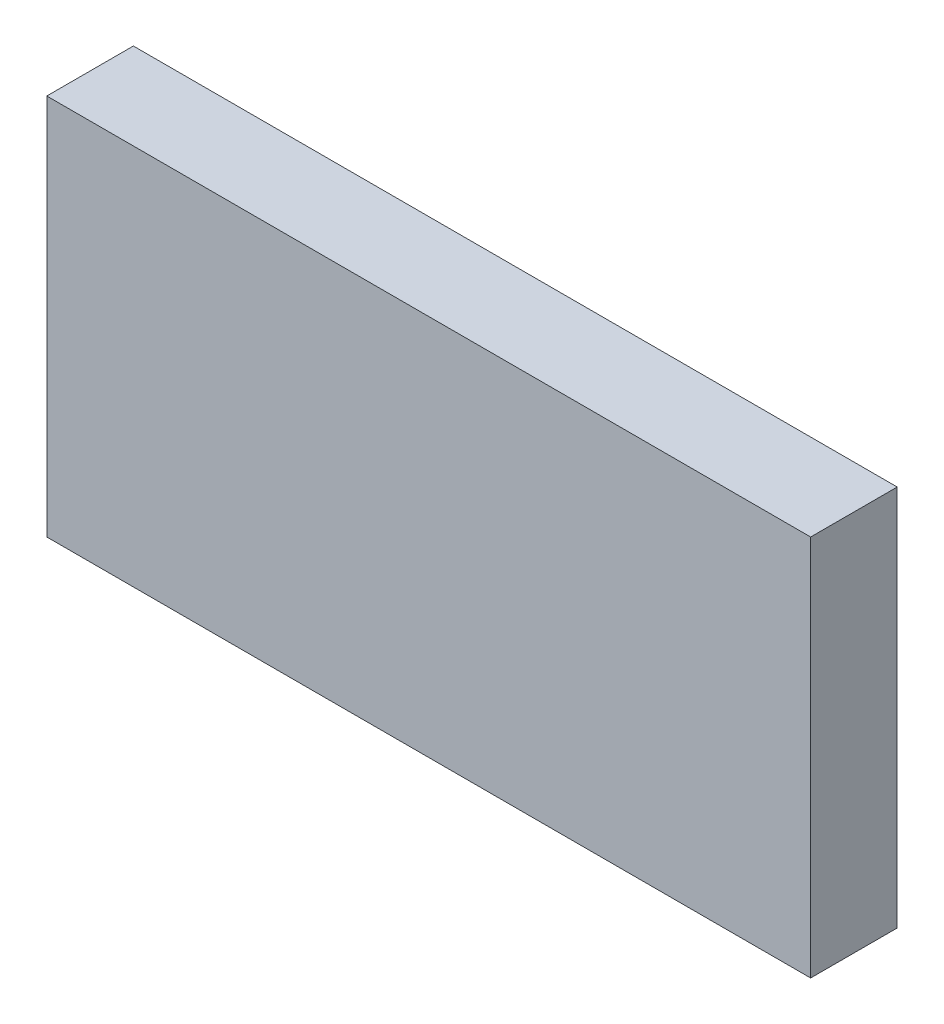
ISO-10303-21;
HEADER;
FILE_DESCRIPTION(('STEP AP214'),'2;1');
FILE_NAME('part.step','',(''),(''),'','','');
FILE_SCHEMA(('AUTOMOTIVE_DESIGN { 1 0 10303 214 1 1 1 1 }'));
ENDSEC;
DATA;
#1=APPLICATION_CONTEXT('core data for automotive mechanical design processes');
#2=APPLICATION_PROTOCOL_DEFINITION('international standard','automotive_design',2000,#1);
#3=PRODUCT_CONTEXT('',#1,'mechanical');
#4=PRODUCT('Part','Part','',(#3));
#5=PRODUCT_RELATED_PRODUCT_CATEGORY('part','',(#4));
#6=PRODUCT_DEFINITION_FORMATION('','',#4);
#7=PRODUCT_DEFINITION_CONTEXT('part definition',#1,'design');
#8=PRODUCT_DEFINITION('design','',#6,#7);
#9=PRODUCT_DEFINITION_SHAPE('','',#8);
#10=(LENGTH_UNIT() NAMED_UNIT(*) SI_UNIT(.MILLI.,.METRE.));
#11=(NAMED_UNIT(*) PLANE_ANGLE_UNIT() SI_UNIT($,.RADIAN.));
#12=(NAMED_UNIT(*) SI_UNIT($,.STERADIAN.) SOLID_ANGLE_UNIT());
#13=UNCERTAINTY_MEASURE_WITH_UNIT(LENGTH_MEASURE(1.E-05),#10,'distance_accuracy_value','');
#14=(GEOMETRIC_REPRESENTATION_CONTEXT(3) GLOBAL_UNCERTAINTY_ASSIGNED_CONTEXT((#13)) GLOBAL_UNIT_ASSIGNED_CONTEXT((#10,
#11,#12)) REPRESENTATION_CONTEXT('',''));
#15=CARTESIAN_POINT('',(0.,0.,0.));
#16=DIRECTION('',(0.,0.,1.));
#17=DIRECTION('',(1.,0.,0.));
#18=AXIS2_PLACEMENT_3D('',#15,#16,#17);
#19=CARTESIAN_POINT('',(0.,0.,3.4));
#20=DIRECTION('',(1.,0.,0.));
#21=DIRECTION('',(0.,0.,-1.));
#22=AXIS2_PLACEMENT_3D('',#19,#20,#21);
#23=PLANE('',#22);
#24=DIRECTION('',(0.,-1.,0.));
#25=VECTOR('',#24,1.);
#26=CARTESIAN_POINT('',(0.,0.,0.));
#27=LINE('',#26,#25);
#28=CARTESIAN_POINT('',(0.,15.,0.));
#29=VERTEX_POINT('',#28);
#30=CARTESIAN_POINT('',(0.,0.,0.));
#31=VERTEX_POINT('',#30);
#32=EDGE_CURVE('E95',#29,#31,#27,.T.);
#33=ORIENTED_EDGE('',*,*,#32,.T.);
#34=DIRECTION('',(0.,0.,-1.));
#35=VECTOR('',#34,1.);
#36=CARTESIAN_POINT('',(0.,0.,3.4));
#37=LINE('',#36,#35);
#38=CARTESIAN_POINT('',(0.,0.,3.4));
#39=VERTEX_POINT('',#38);
#40=EDGE_CURVE('E11',#39,#31,#37,.T.);
#41=ORIENTED_EDGE('',*,*,#40,.F.);
#42=DIRECTION('',(0.,-1.,0.));
#43=VECTOR('',#42,1.);
#44=CARTESIAN_POINT('',(0.,0.,3.4));
#45=LINE('',#44,#43);
#46=CARTESIAN_POINT('',(0.,15.,3.4));
#47=VERTEX_POINT('',#46);
#48=EDGE_CURVE('E83',#47,#39,#45,.T.);
#49=ORIENTED_EDGE('',*,*,#48,.F.);
#50=DIRECTION('',(0.,0.,-1.));
#51=VECTOR('',#50,1.);
#52=CARTESIAN_POINT('',(0.,15.,3.4));
#53=LINE('',#52,#51);
#54=EDGE_CURVE('E91',#47,#29,#53,.T.);
#55=ORIENTED_EDGE('',*,*,#54,.T.);
#56=EDGE_LOOP('',(#33,#41,#49,#55));
#57=FACE_BOUND('',#56,.T.);
#58=ADVANCED_FACE('F32',(#57),#23,.F.);
#59=CARTESIAN_POINT('',(0.,0.,3.4));
#60=DIRECTION('',(0.,1.,0.));
#61=DIRECTION('',(0.,0.,1.));
#62=AXIS2_PLACEMENT_3D('',#59,#60,#61);
#63=PLANE('',#62);
#64=DIRECTION('',(1.,0.,0.));
#65=VECTOR('',#64,1.);
#66=CARTESIAN_POINT('',(0.,0.,0.));
#67=LINE('',#66,#65);
#68=CARTESIAN_POINT('',(30.,0.,0.));
#69=VERTEX_POINT('',#68);
#70=EDGE_CURVE('E87',#31,#69,#67,.T.);
#71=ORIENTED_EDGE('',*,*,#70,.T.);
#72=DIRECTION('',(0.,0.,-1.));
#73=VECTOR('',#72,1.);
#74=CARTESIAN_POINT('',(30.,0.,3.4));
#75=LINE('',#74,#73);
#76=CARTESIAN_POINT('',(30.,0.,3.4));
#77=VERTEX_POINT('',#76);
#78=EDGE_CURVE('E40',#77,#69,#75,.T.);
#79=ORIENTED_EDGE('',*,*,#78,.F.);
#80=DIRECTION('',(1.,0.,0.));
#81=VECTOR('',#80,1.);
#82=CARTESIAN_POINT('',(0.,0.,3.4));
#83=LINE('',#82,#81);
#84=EDGE_CURVE('E78',#39,#77,#83,.T.);
#85=ORIENTED_EDGE('',*,*,#84,.F.);
#86=ORIENTED_EDGE('',*,*,#40,.T.);
#87=EDGE_LOOP('',(#71,#79,#85,#86));
#88=FACE_BOUND('',#87,.T.);
#89=ADVANCED_FACE('F86',(#88),#63,.F.);
#90=CARTESIAN_POINT('',(30.,0.,3.4));
#91=DIRECTION('',(-1.,0.,0.));
#92=DIRECTION('',(0.,0.,1.));
#93=AXIS2_PLACEMENT_3D('',#90,#91,#92);
#94=PLANE('',#93);
#95=DIRECTION('',(0.,1.,0.));
#96=VECTOR('',#95,1.);
#97=CARTESIAN_POINT('',(30.,0.,0.));
#98=LINE('',#97,#96);
#99=CARTESIAN_POINT('',(30.,15.,0.));
#100=VERTEX_POINT('',#99);
#101=EDGE_CURVE('E65',#69,#100,#98,.T.);
#102=ORIENTED_EDGE('',*,*,#101,.T.);
#103=DIRECTION('',(0.,0.,-1.));
#104=VECTOR('',#103,1.);
#105=CARTESIAN_POINT('',(30.,15.,3.4));
#106=LINE('',#105,#104);
#107=CARTESIAN_POINT('',(30.,15.,3.4));
#108=VERTEX_POINT('',#107);
#109=EDGE_CURVE('E88',#108,#100,#106,.T.);
#110=ORIENTED_EDGE('',*,*,#109,.F.);
#111=DIRECTION('',(0.,1.,0.));
#112=VECTOR('',#111,1.);
#113=CARTESIAN_POINT('',(30.,0.,3.4));
#114=LINE('',#113,#112);
#115=EDGE_CURVE('E81',#77,#108,#114,.T.);
#116=ORIENTED_EDGE('',*,*,#115,.F.);
#117=ORIENTED_EDGE('',*,*,#78,.T.);
#118=EDGE_LOOP('',(#102,#110,#116,#117));
#119=FACE_BOUND('',#118,.T.);
#120=ADVANCED_FACE('F89',(#119),#94,.F.);
#121=CARTESIAN_POINT('',(0.,15.,3.4));
#122=DIRECTION('',(0.,-1.,0.));
#123=DIRECTION('',(0.,0.,-1.));
#124=AXIS2_PLACEMENT_3D('',#121,#122,#123);
#125=PLANE('',#124);
#126=DIRECTION('',(-1.,0.,0.));
#127=VECTOR('',#126,1.);
#128=CARTESIAN_POINT('',(0.,15.,0.));
#129=LINE('',#128,#127);
#130=EDGE_CURVE('E71',#100,#29,#129,.T.);
#131=ORIENTED_EDGE('',*,*,#130,.T.);
#132=ORIENTED_EDGE('',*,*,#54,.F.);
#133=DIRECTION('',(-1.,0.,0.));
#134=VECTOR('',#133,1.);
#135=CARTESIAN_POINT('',(0.,15.,3.4));
#136=LINE('',#135,#134);
#137=EDGE_CURVE('E48',#108,#47,#136,.T.);
#138=ORIENTED_EDGE('',*,*,#137,.F.);
#139=ORIENTED_EDGE('',*,*,#109,.T.);
#140=EDGE_LOOP('',(#131,#132,#138,#139));
#141=FACE_BOUND('',#140,.T.);
#142=ADVANCED_FACE('F102',(#141),#125,.F.);
#143=CARTESIAN_POINT('',(0.,0.,3.4));
#144=DIRECTION('',(0.,0.,-1.));
#145=DIRECTION('',(-1.,0.,0.));
#146=AXIS2_PLACEMENT_3D('',#143,#144,#145);
#147=PLANE('',#146);
#148=ORIENTED_EDGE('',*,*,#48,.T.);
#149=ORIENTED_EDGE('',*,*,#84,.T.);
#150=ORIENTED_EDGE('',*,*,#115,.T.);
#151=ORIENTED_EDGE('',*,*,#137,.T.);
#152=EDGE_LOOP('',(#148,#149,#150,#151));
#153=FACE_BOUND('',#152,.T.);
#154=ADVANCED_FACE('F79',(#153),#147,.F.);
#155=CARTESIAN_POINT('',(0.,0.,0.));
#156=DIRECTION('',(0.,0.,-1.));
#157=DIRECTION('',(-1.,0.,0.));
#158=AXIS2_PLACEMENT_3D('',#155,#156,#157);
#159=PLANE('',#158);
#160=ORIENTED_EDGE('',*,*,#32,.F.);
#161=ORIENTED_EDGE('',*,*,#130,.F.);
#162=ORIENTED_EDGE('',*,*,#101,.F.);
#163=ORIENTED_EDGE('',*,*,#70,.F.);
#164=EDGE_LOOP('',(#160,#161,#162,#163));
#165=FACE_BOUND('',#164,.T.);
#166=ADVANCED_FACE('F105',(#165),#159,.T.);
#167=CLOSED_SHELL('',(#58,#89,#120,#142,#154,#166));
#168=MANIFOLD_SOLID_BREP('B2',#167);
#169=ADVANCED_BREP_SHAPE_REPRESENTATION('',(#18,#168),#14);
#170=SHAPE_DEFINITION_REPRESENTATION(#9,#169);
ENDSEC;
END-ISO-10303-21;
